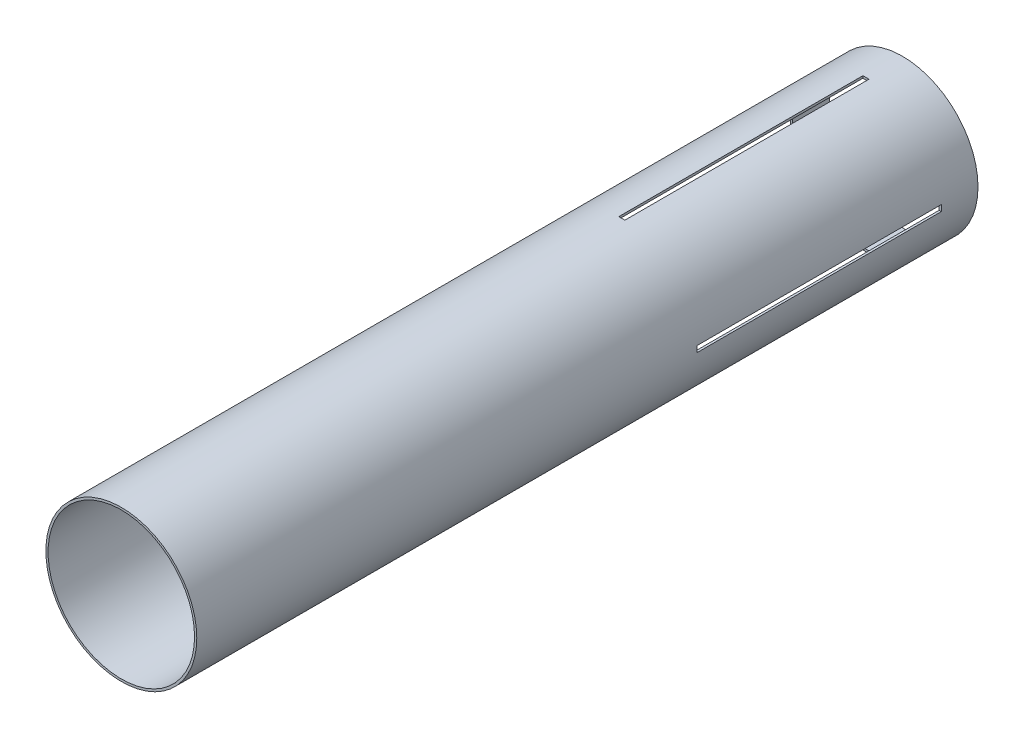
ISO-10303-21;
HEADER;
FILE_DESCRIPTION(('STEP AP214'),'2;1');
FILE_NAME('part.step','',(''),(''),'','','');
FILE_SCHEMA(('AUTOMOTIVE_DESIGN { 1 0 10303 214 1 1 1 1 }'));
ENDSEC;
DATA;
#1=APPLICATION_CONTEXT('core data for automotive mechanical design processes');
#2=APPLICATION_PROTOCOL_DEFINITION('international standard','automotive_design',2000,#1);
#3=PRODUCT_CONTEXT('',#1,'mechanical');
#4=PRODUCT('Part','Part','',(#3));
#5=PRODUCT_RELATED_PRODUCT_CATEGORY('part','',(#4));
#6=PRODUCT_DEFINITION_FORMATION('','',#4);
#7=PRODUCT_DEFINITION_CONTEXT('part definition',#1,'design');
#8=PRODUCT_DEFINITION('design','',#6,#7);
#9=PRODUCT_DEFINITION_SHAPE('','',#8);
#10=(LENGTH_UNIT() NAMED_UNIT(*) SI_UNIT(.MILLI.,.METRE.));
#11=(NAMED_UNIT(*) PLANE_ANGLE_UNIT() SI_UNIT($,.RADIAN.));
#12=(NAMED_UNIT(*) SI_UNIT($,.STERADIAN.) SOLID_ANGLE_UNIT());
#13=UNCERTAINTY_MEASURE_WITH_UNIT(LENGTH_MEASURE(1.E-05),#10,'distance_accuracy_value','');
#14=(GEOMETRIC_REPRESENTATION_CONTEXT(3) GLOBAL_UNCERTAINTY_ASSIGNED_CONTEXT((#13)) GLOBAL_UNIT_ASSIGNED_CONTEXT((#10,
#11,#12)) REPRESENTATION_CONTEXT('',''));
#15=CARTESIAN_POINT('',(0.,0.,0.));
#16=DIRECTION('',(0.,0.,1.));
#17=DIRECTION('',(1.,0.,0.));
#18=AXIS2_PLACEMENT_3D('',#15,#16,#17);
#19=CARTESIAN_POINT('',(0.,0.,203.2));
#20=DIRECTION('',(0.,0.,-1.));
#21=DIRECTION('',(-1.,0.,0.));
#22=AXIS2_PLACEMENT_3D('',#19,#20,#21);
#23=CYLINDRICAL_SURFACE('',#22,39.2557);
#24=CARTESIAN_POINT('',(0.,0.,-57.15));
#25=DIRECTION('',(0.,0.,-1.));
#26=DIRECTION('',(-1.,0.,0.));
#27=AXIS2_PLACEMENT_3D('',#24,#25,#26);
#28=CIRCLE('',#27,39.2557);
#29=CARTESIAN_POINT('',(-39.2235876258152,-1.58750000000014,-57.15));
#30=VERTEX_POINT('',#29);
#31=CARTESIAN_POINT('',(-39.2235876258152,1.58749999999987,-57.15));
#32=VERTEX_POINT('',#31);
#33=EDGE_CURVE('E216',#30,#32,#28,.T.);
#34=ORIENTED_EDGE('',*,*,#33,.F.);
#35=DIRECTION('',(0.,0.,-1.));
#36=VECTOR('',#35,1.);
#37=CARTESIAN_POINT('',(-39.2235876258152,-1.58750000000014,203.2));
#38=LINE('',#37,#36);
#39=CARTESIAN_POINT('',(-39.2235876258152,-1.58750000000014,-184.15));
#40=VERTEX_POINT('',#39);
#41=EDGE_CURVE('E239',#40,#30,#38,.F.);
#42=ORIENTED_EDGE('',*,*,#41,.F.);
#43=CARTESIAN_POINT('',(0.,0.,-184.15));
#44=DIRECTION('',(0.,0.,1.));
#45=DIRECTION('',(1.,0.,0.));
#46=AXIS2_PLACEMENT_3D('',#43,#44,#45);
#47=CIRCLE('',#46,39.2557);
#48=CARTESIAN_POINT('',(-39.2235876258152,1.58749999999986,-184.15));
#49=VERTEX_POINT('',#48);
#50=EDGE_CURVE('E232',#49,#40,#47,.T.);
#51=ORIENTED_EDGE('',*,*,#50,.F.);
#52=DIRECTION('',(0.,0.,-1.));
#53=VECTOR('',#52,1.);
#54=CARTESIAN_POINT('',(-39.2235876258152,1.58749999999986,203.2));
#55=LINE('',#54,#53);
#56=EDGE_CURVE('E236',#32,#49,#55,.T.);
#57=ORIENTED_EDGE('',*,*,#56,.F.);
#58=EDGE_LOOP('',(#34,#42,#51,#57));
#59=FACE_BOUND('',#58,.T.);
#60=CARTESIAN_POINT('',(1.5875,-39.2235876258152,-57.15));
#61=VERTEX_POINT('',#60);
#62=CARTESIAN_POINT('',(-1.5875,-39.2235876258152,-57.15));
#63=VERTEX_POINT('',#62);
#64=EDGE_CURVE('E240',#61,#63,#28,.T.);
#65=ORIENTED_EDGE('',*,*,#64,.F.);
#66=DIRECTION('',(0.,0.,-1.));
#67=VECTOR('',#66,1.);
#68=CARTESIAN_POINT('',(1.5875,-39.2235876258152,203.2));
#69=LINE('',#68,#67);
#70=CARTESIAN_POINT('',(1.5875,-39.2235876258152,-184.15));
#71=VERTEX_POINT('',#70);
#72=EDGE_CURVE('E227',#71,#61,#69,.F.);
#73=ORIENTED_EDGE('',*,*,#72,.F.);
#74=CARTESIAN_POINT('',(-1.5875,-39.2235876258152,-184.15));
#75=VERTEX_POINT('',#74);
#76=EDGE_CURVE('E59',#75,#71,#47,.T.);
#77=ORIENTED_EDGE('',*,*,#76,.F.);
#78=DIRECTION('',(0.,0.,-1.));
#79=VECTOR('',#78,1.);
#80=CARTESIAN_POINT('',(-1.5875,-39.2235876258152,203.2));
#81=LINE('',#80,#79);
#82=EDGE_CURVE('E229',#63,#75,#81,.T.);
#83=ORIENTED_EDGE('',*,*,#82,.F.);
#84=EDGE_LOOP('',(#65,#73,#77,#83));
#85=FACE_BOUND('',#84,.T.);
#86=CARTESIAN_POINT('',(0.,0.,203.2));
#87=DIRECTION('',(0.,0.,1.));
#88=DIRECTION('',(1.,0.,0.));
#89=AXIS2_PLACEMENT_3D('',#86,#87,#88);
#90=CIRCLE('',#89,39.2557);
#91=CARTESIAN_POINT('',(39.2557,0.,203.2));
#92=VERTEX_POINT('',#91);
#93=EDGE_CURVE('E269',#92,#92,#90,.T.);
#94=ORIENTED_EDGE('',*,*,#93,.F.);
#95=EDGE_LOOP('',(#94));
#96=FACE_BOUND('',#95,.T.);
#97=CARTESIAN_POINT('',(0.,0.,-203.2));
#98=DIRECTION('',(0.,0.,1.));
#99=DIRECTION('',(1.,0.,0.));
#100=AXIS2_PLACEMENT_3D('',#97,#98,#99);
#101=CIRCLE('',#100,39.2557);
#102=CARTESIAN_POINT('',(39.2557,0.,-203.2));
#103=VERTEX_POINT('',#102);
#104=EDGE_CURVE('E266',#103,#103,#101,.T.);
#105=ORIENTED_EDGE('',*,*,#104,.T.);
#106=EDGE_LOOP('',(#105));
#107=FACE_BOUND('',#106,.T.);
#108=CARTESIAN_POINT('',(0.,0.,-184.15));
#109=DIRECTION('',(0.,0.,1.));
#110=DIRECTION('',(1.,0.,0.));
#111=AXIS2_PLACEMENT_3D('',#108,#109,#110);
#112=CIRCLE('',#111,39.2557);
#113=CARTESIAN_POINT('',(1.5875,39.2235876258152,-184.15));
#114=VERTEX_POINT('',#113);
#115=CARTESIAN_POINT('',(-1.5875,39.2235876258152,-184.15));
#116=VERTEX_POINT('',#115);
#117=EDGE_CURVE('E254',#114,#116,#112,.T.);
#118=ORIENTED_EDGE('',*,*,#117,.F.);
#119=DIRECTION('',(0.,0.,-1.));
#120=VECTOR('',#119,1.);
#121=CARTESIAN_POINT('',(1.5875,39.2235876258152,203.2));
#122=LINE('',#121,#120);
#123=CARTESIAN_POINT('',(1.5875,39.2235876258152,-57.15));
#124=VERTEX_POINT('',#123);
#125=EDGE_CURVE('E256',#124,#114,#122,.T.);
#126=ORIENTED_EDGE('',*,*,#125,.F.);
#127=CARTESIAN_POINT('',(0.,0.,-57.15));
#128=DIRECTION('',(0.,0.,-1.));
#129=DIRECTION('',(-1.,0.,0.));
#130=AXIS2_PLACEMENT_3D('',#127,#128,#129);
#131=CIRCLE('',#130,39.2557);
#132=CARTESIAN_POINT('',(-1.5875,39.2235876258152,-57.15));
#133=VERTEX_POINT('',#132);
#134=EDGE_CURVE('E258',#133,#124,#131,.T.);
#135=ORIENTED_EDGE('',*,*,#134,.F.);
#136=DIRECTION('',(0.,0.,-1.));
#137=VECTOR('',#136,1.);
#138=CARTESIAN_POINT('',(-1.5875,39.2235876258152,203.2));
#139=LINE('',#138,#137);
#140=EDGE_CURVE('E260',#116,#133,#139,.F.);
#141=ORIENTED_EDGE('',*,*,#140,.F.);
#142=EDGE_LOOP('',(#118,#126,#135,#141));
#143=FACE_BOUND('',#142,.T.);
#144=CARTESIAN_POINT('',(39.2235876258151,1.58750000000014,-57.15));
#145=VERTEX_POINT('',#144);
#146=CARTESIAN_POINT('',(39.2235876258152,-1.58749999999959,-57.15));
#147=VERTEX_POINT('',#146);
#148=EDGE_CURVE('E67',#145,#147,#28,.T.);
#149=ORIENTED_EDGE('',*,*,#148,.F.);
#150=DIRECTION('',(0.,0.,-1.));
#151=VECTOR('',#150,1.);
#152=CARTESIAN_POINT('',(39.2235876258152,1.58750000000014,203.2));
#153=LINE('',#152,#151);
#154=CARTESIAN_POINT('',(39.2235876258152,1.58750000000014,-184.15));
#155=VERTEX_POINT('',#154);
#156=EDGE_CURVE('E234',#155,#145,#153,.F.);
#157=ORIENTED_EDGE('',*,*,#156,.F.);
#158=CARTESIAN_POINT('',(39.2235876258152,-1.58749999999959,-184.15));
#159=VERTEX_POINT('',#158);
#160=EDGE_CURVE('E231',#159,#155,#47,.T.);
#161=ORIENTED_EDGE('',*,*,#160,.F.);
#162=DIRECTION('',(0.,0.,-1.));
#163=VECTOR('',#162,1.);
#164=CARTESIAN_POINT('',(39.2235876258152,-1.58749999999959,203.2));
#165=LINE('',#164,#163);
#166=EDGE_CURVE('E220',#147,#159,#165,.T.);
#167=ORIENTED_EDGE('',*,*,#166,.F.);
#168=EDGE_LOOP('',(#149,#157,#161,#167));
#169=FACE_BOUND('',#168,.T.);
#170=ADVANCED_FACE('F45',(#59,#85,#96,#107,#143,#169),#23,.T.);
#171=CARTESIAN_POINT('',(0.,0.,203.2));
#172=DIRECTION('',(0.,0.,-1.));
#173=DIRECTION('',(-1.,0.,0.));
#174=AXIS2_PLACEMENT_3D('',#171,#172,#173);
#175=CYLINDRICAL_SURFACE('',#174,38.1);
#176=CARTESIAN_POINT('',(0.,0.,203.2));
#177=DIRECTION('',(0.,0.,1.));
#178=DIRECTION('',(1.,0.,0.));
#179=AXIS2_PLACEMENT_3D('',#176,#177,#178);
#180=CIRCLE('',#179,38.1);
#181=CARTESIAN_POINT('',(38.1,0.,203.2));
#182=VERTEX_POINT('',#181);
#183=EDGE_CURVE('E263',#182,#182,#180,.T.);
#184=ORIENTED_EDGE('',*,*,#183,.T.);
#185=EDGE_LOOP('',(#184));
#186=FACE_BOUND('',#185,.T.);
#187=CARTESIAN_POINT('',(0.,0.,-203.2));
#188=DIRECTION('',(0.,0.,1.));
#189=DIRECTION('',(1.,0.,0.));
#190=AXIS2_PLACEMENT_3D('',#187,#188,#189);
#191=CIRCLE('',#190,38.1);
#192=CARTESIAN_POINT('',(38.1,0.,-203.2));
#193=VERTEX_POINT('',#192);
#194=EDGE_CURVE('E262',#193,#193,#191,.T.);
#195=ORIENTED_EDGE('',*,*,#194,.F.);
#196=EDGE_LOOP('',(#195));
#197=FACE_BOUND('',#196,.T.);
#198=CARTESIAN_POINT('',(0.,0.,-184.15));
#199=DIRECTION('',(0.,0.,1.));
#200=DIRECTION('',(1.,0.,0.));
#201=AXIS2_PLACEMENT_3D('',#198,#199,#200);
#202=CIRCLE('',#201,38.1);
#203=CARTESIAN_POINT('',(1.5875,38.0669127162947,-184.15));
#204=VERTEX_POINT('',#203);
#205=CARTESIAN_POINT('',(-1.5875,38.0669127162947,-184.15));
#206=VERTEX_POINT('',#205);
#207=EDGE_CURVE('E272',#204,#206,#202,.T.);
#208=ORIENTED_EDGE('',*,*,#207,.T.);
#209=DIRECTION('',(0.,0.,-1.));
#210=VECTOR('',#209,1.);
#211=CARTESIAN_POINT('',(-1.5875,38.0669127162947,203.2));
#212=LINE('',#211,#210);
#213=CARTESIAN_POINT('',(-1.5875,38.0669127162947,-57.15));
#214=VERTEX_POINT('',#213);
#215=EDGE_CURVE('E172',#206,#214,#212,.F.);
#216=ORIENTED_EDGE('',*,*,#215,.T.);
#217=CARTESIAN_POINT('',(0.,0.,-57.15));
#218=DIRECTION('',(0.,0.,-1.));
#219=DIRECTION('',(-1.,0.,0.));
#220=AXIS2_PLACEMENT_3D('',#217,#218,#219);
#221=CIRCLE('',#220,38.1);
#222=CARTESIAN_POINT('',(1.5875,38.0669127162947,-57.15));
#223=VERTEX_POINT('',#222);
#224=EDGE_CURVE('E280',#214,#223,#221,.T.);
#225=ORIENTED_EDGE('',*,*,#224,.T.);
#226=DIRECTION('',(0.,0.,-1.));
#227=VECTOR('',#226,1.);
#228=CARTESIAN_POINT('',(1.5875,38.0669127162947,203.2));
#229=LINE('',#228,#227);
#230=EDGE_CURVE('E277',#223,#204,#229,.T.);
#231=ORIENTED_EDGE('',*,*,#230,.T.);
#232=EDGE_LOOP('',(#208,#216,#225,#231));
#233=FACE_BOUND('',#232,.T.);
#234=DIRECTION('',(0.,0.,-1.));
#235=VECTOR('',#234,1.);
#236=CARTESIAN_POINT('',(38.0669127162947,1.58750000000013,203.2));
#237=LINE('',#236,#235);
#238=CARTESIAN_POINT('',(38.0669127162947,1.58750000000013,-184.15));
#239=VERTEX_POINT('',#238);
#240=CARTESIAN_POINT('',(38.0669127162947,1.58750000000013,-57.15));
#241=VERTEX_POINT('',#240);
#242=EDGE_CURVE('E182',#239,#241,#237,.F.);
#243=ORIENTED_EDGE('',*,*,#242,.T.);
#244=CARTESIAN_POINT('',(0.,0.,-57.15));
#245=DIRECTION('',(0.,0.,-1.));
#246=DIRECTION('',(-1.,0.,0.));
#247=AXIS2_PLACEMENT_3D('',#244,#245,#246);
#248=CIRCLE('',#247,38.1);
#249=CARTESIAN_POINT('',(38.0669127162947,-1.5874999999996,-57.15));
#250=VERTEX_POINT('',#249);
#251=EDGE_CURVE('E175',#241,#250,#248,.T.);
#252=ORIENTED_EDGE('',*,*,#251,.T.);
#253=DIRECTION('',(0.,0.,-1.));
#254=VECTOR('',#253,1.);
#255=CARTESIAN_POINT('',(38.0669127162947,-1.5874999999996,203.2));
#256=LINE('',#255,#254);
#257=CARTESIAN_POINT('',(38.0669127162947,-1.5874999999996,-184.15));
#258=VERTEX_POINT('',#257);
#259=EDGE_CURVE('E160',#250,#258,#256,.T.);
#260=ORIENTED_EDGE('',*,*,#259,.T.);
#261=CARTESIAN_POINT('',(0.,0.,-184.15));
#262=DIRECTION('',(0.,0.,1.));
#263=DIRECTION('',(1.,0.,0.));
#264=AXIS2_PLACEMENT_3D('',#261,#262,#263);
#265=CIRCLE('',#264,38.1);
#266=EDGE_CURVE('E171',#258,#239,#265,.T.);
#267=ORIENTED_EDGE('',*,*,#266,.T.);
#268=EDGE_LOOP('',(#243,#252,#260,#267));
#269=FACE_BOUND('',#268,.T.);
#270=CARTESIAN_POINT('',(1.5875,-38.0669127162947,-57.1499999999999));
#271=VERTEX_POINT('',#270);
#272=CARTESIAN_POINT('',(-1.5875,-38.0669127162947,-57.15));
#273=VERTEX_POINT('',#272);
#274=EDGE_CURVE('E185',#271,#273,#248,.T.);
#275=ORIENTED_EDGE('',*,*,#274,.T.);
#276=DIRECTION('',(0.,0.,-1.));
#277=VECTOR('',#276,1.);
#278=CARTESIAN_POINT('',(-1.5875,-38.0669127162947,203.2));
#279=LINE('',#278,#277);
#280=CARTESIAN_POINT('',(-1.5875,-38.0669127162947,-184.15));
#281=VERTEX_POINT('',#280);
#282=EDGE_CURVE('E193',#273,#281,#279,.T.);
#283=ORIENTED_EDGE('',*,*,#282,.T.);
#284=CARTESIAN_POINT('',(1.5875,-38.0669127162947,-184.15));
#285=VERTEX_POINT('',#284);
#286=EDGE_CURVE('E187',#281,#285,#265,.T.);
#287=ORIENTED_EDGE('',*,*,#286,.T.);
#288=DIRECTION('',(0.,0.,-1.));
#289=VECTOR('',#288,1.);
#290=CARTESIAN_POINT('',(1.5875,-38.0669127162947,203.2));
#291=LINE('',#290,#289);
#292=EDGE_CURVE('E183',#285,#271,#291,.F.);
#293=ORIENTED_EDGE('',*,*,#292,.T.);
#294=EDGE_LOOP('',(#275,#283,#287,#293));
#295=FACE_BOUND('',#294,.T.);
#296=CARTESIAN_POINT('',(-38.0669127162947,1.58749999999987,-184.15));
#297=VERTEX_POINT('',#296);
#298=CARTESIAN_POINT('',(-38.0669127162947,-1.58750000000013,-184.15));
#299=VERTEX_POINT('',#298);
#300=EDGE_CURVE('E196',#297,#299,#265,.T.);
#301=ORIENTED_EDGE('',*,*,#300,.T.);
#302=DIRECTION('',(0.,0.,-1.));
#303=VECTOR('',#302,1.);
#304=CARTESIAN_POINT('',(-38.0669127162947,-1.58750000000013,203.2));
#305=LINE('',#304,#303);
#306=CARTESIAN_POINT('',(-38.0669127162947,-1.58750000000013,-57.15));
#307=VERTEX_POINT('',#306);
#308=EDGE_CURVE('E11',#299,#307,#305,.F.);
#309=ORIENTED_EDGE('',*,*,#308,.T.);
#310=CARTESIAN_POINT('',(-38.0669127162947,1.58749999999987,-57.15));
#311=VERTEX_POINT('',#310);
#312=EDGE_CURVE('E52',#307,#311,#248,.T.);
#313=ORIENTED_EDGE('',*,*,#312,.T.);
#314=DIRECTION('',(0.,0.,-1.));
#315=VECTOR('',#314,1.);
#316=CARTESIAN_POINT('',(-38.0669127162947,1.58749999999987,203.2));
#317=LINE('',#316,#315);
#318=EDGE_CURVE('E191',#311,#297,#317,.T.);
#319=ORIENTED_EDGE('',*,*,#318,.T.);
#320=EDGE_LOOP('',(#301,#309,#313,#319));
#321=FACE_BOUND('',#320,.T.);
#322=ADVANCED_FACE('F180',(#186,#197,#233,#269,#295,#321),#175,.F.);
#323=CARTESIAN_POINT('',(0.,0.,203.2));
#324=DIRECTION('',(0.,0.,1.));
#325=DIRECTION('',(1.,0.,0.));
#326=AXIS2_PLACEMENT_3D('',#323,#324,#325);
#327=PLANE('',#326);
#328=ORIENTED_EDGE('',*,*,#93,.T.);
#329=EDGE_LOOP('',(#328));
#330=FACE_BOUND('',#329,.T.);
#331=ORIENTED_EDGE('',*,*,#183,.F.);
#332=EDGE_LOOP('',(#331));
#333=FACE_BOUND('',#332,.T.);
#334=ADVANCED_FACE('F320',(#330,#333),#327,.T.);
#335=CARTESIAN_POINT('',(0.,0.,-203.2));
#336=DIRECTION('',(0.,0.,1.));
#337=DIRECTION('',(1.,0.,0.));
#338=AXIS2_PLACEMENT_3D('',#335,#336,#337);
#339=PLANE('',#338);
#340=ORIENTED_EDGE('',*,*,#104,.F.);
#341=EDGE_LOOP('',(#340));
#342=FACE_BOUND('',#341,.T.);
#343=ORIENTED_EDGE('',*,*,#194,.T.);
#344=EDGE_LOOP('',(#343));
#345=FACE_BOUND('',#344,.T.);
#346=ADVANCED_FACE('F333',(#342,#345),#339,.F.);
#347=CARTESIAN_POINT('',(-1.5875,39.2557,-57.15));
#348=DIRECTION('',(1.,0.,0.));
#349=DIRECTION('',(0.,0.,-1.));
#350=AXIS2_PLACEMENT_3D('',#347,#348,#349);
#351=PLANE('',#350);
#352=ORIENTED_EDGE('',*,*,#140,.T.);
#353=DIRECTION('',(0.,-1.,0.));
#354=VECTOR('',#353,1.);
#355=CARTESIAN_POINT('',(-1.5875,39.2557,-57.15));
#356=LINE('',#355,#354);
#357=EDGE_CURVE('E251',#133,#214,#356,.T.);
#358=ORIENTED_EDGE('',*,*,#357,.T.);
#359=ORIENTED_EDGE('',*,*,#215,.F.);
#360=DIRECTION('',(0.,-1.,0.));
#361=VECTOR('',#360,1.);
#362=CARTESIAN_POINT('',(-1.5875,39.2557,-184.15));
#363=LINE('',#362,#361);
#364=EDGE_CURVE('E243',#116,#206,#363,.T.);
#365=ORIENTED_EDGE('',*,*,#364,.F.);
#366=EDGE_LOOP('',(#352,#358,#359,#365));
#367=FACE_BOUND('',#366,.T.);
#368=ADVANCED_FACE('F288',(#367),#351,.T.);
#369=CARTESIAN_POINT('',(1.5875,39.2557,-57.15));
#370=DIRECTION('',(0.,0.,-1.));
#371=DIRECTION('',(-1.,0.,0.));
#372=AXIS2_PLACEMENT_3D('',#369,#370,#371);
#373=PLANE('',#372);
#374=ORIENTED_EDGE('',*,*,#134,.T.);
#375=DIRECTION('',(0.,-1.,0.));
#376=VECTOR('',#375,1.);
#377=CARTESIAN_POINT('',(1.5875,39.2557,-57.15));
#378=LINE('',#377,#376);
#379=EDGE_CURVE('E248',#124,#223,#378,.T.);
#380=ORIENTED_EDGE('',*,*,#379,.T.);
#381=ORIENTED_EDGE('',*,*,#224,.F.);
#382=ORIENTED_EDGE('',*,*,#357,.F.);
#383=EDGE_LOOP('',(#374,#380,#381,#382));
#384=FACE_BOUND('',#383,.T.);
#385=ADVANCED_FACE('F293',(#384),#373,.T.);
#386=CARTESIAN_POINT('',(1.5875,39.2557,-57.15));
#387=DIRECTION('',(-1.,0.,0.));
#388=DIRECTION('',(0.,0.,1.));
#389=AXIS2_PLACEMENT_3D('',#386,#387,#388);
#390=PLANE('',#389);
#391=ORIENTED_EDGE('',*,*,#125,.T.);
#392=DIRECTION('',(0.,-1.,0.));
#393=VECTOR('',#392,1.);
#394=CARTESIAN_POINT('',(1.5875,39.2557,-184.15));
#395=LINE('',#394,#393);
#396=EDGE_CURVE('E245',#114,#204,#395,.T.);
#397=ORIENTED_EDGE('',*,*,#396,.T.);
#398=ORIENTED_EDGE('',*,*,#230,.F.);
#399=ORIENTED_EDGE('',*,*,#379,.F.);
#400=EDGE_LOOP('',(#391,#397,#398,#399));
#401=FACE_BOUND('',#400,.T.);
#402=ADVANCED_FACE('F301',(#401),#390,.T.);
#403=CARTESIAN_POINT('',(1.5875,39.2557,-184.15));
#404=DIRECTION('',(0.,0.,1.));
#405=DIRECTION('',(1.,0.,0.));
#406=AXIS2_PLACEMENT_3D('',#403,#404,#405);
#407=PLANE('',#406);
#408=ORIENTED_EDGE('',*,*,#117,.T.);
#409=ORIENTED_EDGE('',*,*,#364,.T.);
#410=ORIENTED_EDGE('',*,*,#207,.F.);
#411=ORIENTED_EDGE('',*,*,#396,.F.);
#412=EDGE_LOOP('',(#408,#409,#410,#411));
#413=FACE_BOUND('',#412,.T.);
#414=ADVANCED_FACE('F303',(#413),#407,.T.);
#415=CARTESIAN_POINT('',(39.2557000000004,-1.58749999999959,-57.15));
#416=DIRECTION('',(0.,1.,0.));
#417=DIRECTION('',(-1.,0.,0.));
#418=AXIS2_PLACEMENT_3D('',#415,#416,#417);
#419=PLANE('',#418);
#420=ORIENTED_EDGE('',*,*,#166,.T.);
#421=DIRECTION('',(-1.,0.,0.));
#422=VECTOR('',#421,1.);
#423=CARTESIAN_POINT('',(39.2557000000004,-1.58749999999959,-184.15));
#424=LINE('',#423,#422);
#425=EDGE_CURVE('E166',#159,#258,#424,.T.);
#426=ORIENTED_EDGE('',*,*,#425,.T.);
#427=ORIENTED_EDGE('',*,*,#259,.F.);
#428=DIRECTION('',(-1.,0.,0.));
#429=VECTOR('',#428,1.);
#430=CARTESIAN_POINT('',(39.2557000000004,-1.58749999999959,-57.15));
#431=LINE('',#430,#429);
#432=EDGE_CURVE('E163',#147,#250,#431,.T.);
#433=ORIENTED_EDGE('',*,*,#432,.F.);
#434=EDGE_LOOP('',(#420,#426,#427,#433));
#435=FACE_BOUND('',#434,.T.);
#436=ADVANCED_FACE('F162',(#435),#419,.T.);
#437=CARTESIAN_POINT('',(-39.2557000000002,1.58749999999986,-184.15));
#438=DIRECTION('',(0.,0.,1.));
#439=DIRECTION('',(1.,0.,0.));
#440=AXIS2_PLACEMENT_3D('',#437,#438,#439);
#441=PLANE('',#440);
#442=ORIENTED_EDGE('',*,*,#160,.T.);
#443=DIRECTION('',(1.,0.,0.));
#444=VECTOR('',#443,1.);
#445=CARTESIAN_POINT('',(-39.2557000000002,1.58749999999986,-184.15));
#446=LINE('',#445,#444);
#447=EDGE_CURVE('E223',#239,#155,#446,.T.);
#448=ORIENTED_EDGE('',*,*,#447,.F.);
#449=ORIENTED_EDGE('',*,*,#266,.F.);
#450=ORIENTED_EDGE('',*,*,#425,.F.);
#451=EDGE_LOOP('',(#442,#448,#449,#450));
#452=FACE_BOUND('',#451,.T.);
#453=ADVANCED_FACE('F311',(#452),#441,.T.);
#454=CARTESIAN_POINT('',(-39.2557000000002,1.58749999999986,-57.15));
#455=DIRECTION('',(0.,-1.,0.));
#456=DIRECTION('',(1.,0.,0.));
#457=AXIS2_PLACEMENT_3D('',#454,#455,#456);
#458=PLANE('',#457);
#459=ORIENTED_EDGE('',*,*,#156,.T.);
#460=DIRECTION('',(1.,0.,0.));
#461=VECTOR('',#460,1.);
#462=CARTESIAN_POINT('',(-39.2557000000002,1.58749999999986,-57.15));
#463=LINE('',#462,#461);
#464=EDGE_CURVE('E218',#241,#145,#463,.T.);
#465=ORIENTED_EDGE('',*,*,#464,.F.);
#466=ORIENTED_EDGE('',*,*,#242,.F.);
#467=ORIENTED_EDGE('',*,*,#447,.T.);
#468=EDGE_LOOP('',(#459,#465,#466,#467));
#469=FACE_BOUND('',#468,.T.);
#470=ADVANCED_FACE('F391',(#469),#458,.T.);
#471=CARTESIAN_POINT('',(-39.2557000000002,1.58749999999986,-57.15));
#472=DIRECTION('',(0.,0.,-1.));
#473=DIRECTION('',(-1.,0.,0.));
#474=AXIS2_PLACEMENT_3D('',#471,#472,#473);
#475=PLANE('',#474);
#476=ORIENTED_EDGE('',*,*,#148,.T.);
#477=ORIENTED_EDGE('',*,*,#432,.T.);
#478=ORIENTED_EDGE('',*,*,#251,.F.);
#479=ORIENTED_EDGE('',*,*,#464,.T.);
#480=EDGE_LOOP('',(#476,#477,#478,#479));
#481=FACE_BOUND('',#480,.T.);
#482=ADVANCED_FACE('F174',(#481),#475,.T.);
#483=CARTESIAN_POINT('',(1.5875,-39.2557,-57.15));
#484=DIRECTION('',(-1.,0.,0.));
#485=DIRECTION('',(0.,0.,1.));
#486=AXIS2_PLACEMENT_3D('',#483,#484,#485);
#487=PLANE('',#486);
#488=ORIENTED_EDGE('',*,*,#72,.T.);
#489=DIRECTION('',(0.,1.,0.));
#490=VECTOR('',#489,1.);
#491=CARTESIAN_POINT('',(1.5875,-39.2557,-57.15));
#492=LINE('',#491,#490);
#493=EDGE_CURVE('E527',#61,#271,#492,.T.);
#494=ORIENTED_EDGE('',*,*,#493,.T.);
#495=ORIENTED_EDGE('',*,*,#292,.F.);
#496=DIRECTION('',(0.,1.,0.));
#497=VECTOR('',#496,1.);
#498=CARTESIAN_POINT('',(1.5875,-39.2557,-184.15));
#499=LINE('',#498,#497);
#500=EDGE_CURVE('E177',#71,#285,#499,.T.);
#501=ORIENTED_EDGE('',*,*,#500,.F.);
#502=EDGE_LOOP('',(#488,#494,#495,#501));
#503=FACE_BOUND('',#502,.T.);
#504=ADVANCED_FACE('F421',(#503),#487,.T.);
#505=CARTESIAN_POINT('',(-1.5875,-39.2557,-57.15));
#506=DIRECTION('',(1.,0.,0.));
#507=DIRECTION('',(0.,0.,-1.));
#508=AXIS2_PLACEMENT_3D('',#505,#506,#507);
#509=PLANE('',#508);
#510=ORIENTED_EDGE('',*,*,#82,.T.);
#511=DIRECTION('',(0.,1.,0.));
#512=VECTOR('',#511,1.);
#513=CARTESIAN_POINT('',(-1.5875,-39.2557,-184.15));
#514=LINE('',#513,#512);
#515=EDGE_CURVE('E534',#75,#281,#514,.T.);
#516=ORIENTED_EDGE('',*,*,#515,.T.);
#517=ORIENTED_EDGE('',*,*,#282,.F.);
#518=DIRECTION('',(0.,1.,0.));
#519=VECTOR('',#518,1.);
#520=CARTESIAN_POINT('',(-1.5875,-39.2557,-57.15));
#521=LINE('',#520,#519);
#522=EDGE_CURVE('E529',#63,#273,#521,.T.);
#523=ORIENTED_EDGE('',*,*,#522,.F.);
#524=EDGE_LOOP('',(#510,#516,#517,#523));
#525=FACE_BOUND('',#524,.T.);
#526=ADVANCED_FACE('F437',(#525),#509,.T.);
#527=ORIENTED_EDGE('',*,*,#76,.T.);
#528=ORIENTED_EDGE('',*,*,#500,.T.);
#529=ORIENTED_EDGE('',*,*,#286,.F.);
#530=ORIENTED_EDGE('',*,*,#515,.F.);
#531=EDGE_LOOP('',(#527,#528,#529,#530));
#532=FACE_BOUND('',#531,.T.);
#533=ADVANCED_FACE('F395',(#532),#441,.T.);
#534=ORIENTED_EDGE('',*,*,#64,.T.);
#535=ORIENTED_EDGE('',*,*,#522,.T.);
#536=ORIENTED_EDGE('',*,*,#274,.F.);
#537=ORIENTED_EDGE('',*,*,#493,.F.);
#538=EDGE_LOOP('',(#534,#535,#536,#537));
#539=FACE_BOUND('',#538,.T.);
#540=ADVANCED_FACE('F423',(#539),#475,.T.);
#541=CARTESIAN_POINT('',(-39.2557000000001,-1.58750000000014,-57.15));
#542=DIRECTION('',(0.,1.,0.));
#543=DIRECTION('',(-1.,0.,0.));
#544=AXIS2_PLACEMENT_3D('',#541,#542,#543);
#545=PLANE('',#544);
#546=ORIENTED_EDGE('',*,*,#41,.T.);
#547=DIRECTION('',(1.,0.,0.));
#548=VECTOR('',#547,1.);
#549=CARTESIAN_POINT('',(-39.2557000000001,-1.58750000000014,-57.15));
#550=LINE('',#549,#548);
#551=EDGE_CURVE('E217',#30,#307,#550,.T.);
#552=ORIENTED_EDGE('',*,*,#551,.T.);
#553=ORIENTED_EDGE('',*,*,#308,.F.);
#554=DIRECTION('',(1.,0.,0.));
#555=VECTOR('',#554,1.);
#556=CARTESIAN_POINT('',(-39.2557000000001,-1.58750000000014,-184.15));
#557=LINE('',#556,#555);
#558=EDGE_CURVE('E525',#40,#299,#557,.T.);
#559=ORIENTED_EDGE('',*,*,#558,.F.);
#560=EDGE_LOOP('',(#546,#552,#553,#559));
#561=FACE_BOUND('',#560,.T.);
#562=ADVANCED_FACE('F469',(#561),#545,.T.);
#563=ORIENTED_EDGE('',*,*,#33,.T.);
#564=EDGE_CURVE('E208',#32,#311,#463,.T.);
#565=ORIENTED_EDGE('',*,*,#564,.T.);
#566=ORIENTED_EDGE('',*,*,#312,.F.);
#567=ORIENTED_EDGE('',*,*,#551,.F.);
#568=EDGE_LOOP('',(#563,#565,#566,#567));
#569=FACE_BOUND('',#568,.T.);
#570=ADVANCED_FACE('F213',(#569),#475,.T.);
#571=ORIENTED_EDGE('',*,*,#56,.T.);
#572=EDGE_CURVE('E211',#49,#297,#446,.T.);
#573=ORIENTED_EDGE('',*,*,#572,.T.);
#574=ORIENTED_EDGE('',*,*,#318,.F.);
#575=ORIENTED_EDGE('',*,*,#564,.F.);
#576=EDGE_LOOP('',(#571,#573,#574,#575));
#577=FACE_BOUND('',#576,.T.);
#578=ADVANCED_FACE('F207',(#577),#458,.T.);
#579=ORIENTED_EDGE('',*,*,#50,.T.);
#580=ORIENTED_EDGE('',*,*,#558,.T.);
#581=ORIENTED_EDGE('',*,*,#300,.F.);
#582=ORIENTED_EDGE('',*,*,#572,.F.);
#583=EDGE_LOOP('',(#579,#580,#581,#582));
#584=FACE_BOUND('',#583,.T.);
#585=ADVANCED_FACE('F394',(#584),#441,.T.);
#586=CLOSED_SHELL('',(#170,#322,#334,#346,#368,#385,#402,#414,#436,#453,#470,#482,#504,#526,
#533,#540,#562,#570,#578,#585));
#587=MANIFOLD_SOLID_BREP('B2',#586);
#588=ADVANCED_BREP_SHAPE_REPRESENTATION('',(#18,#587),#14);
#589=SHAPE_DEFINITION_REPRESENTATION(#9,#588);
ENDSEC;
END-ISO-10303-21;
